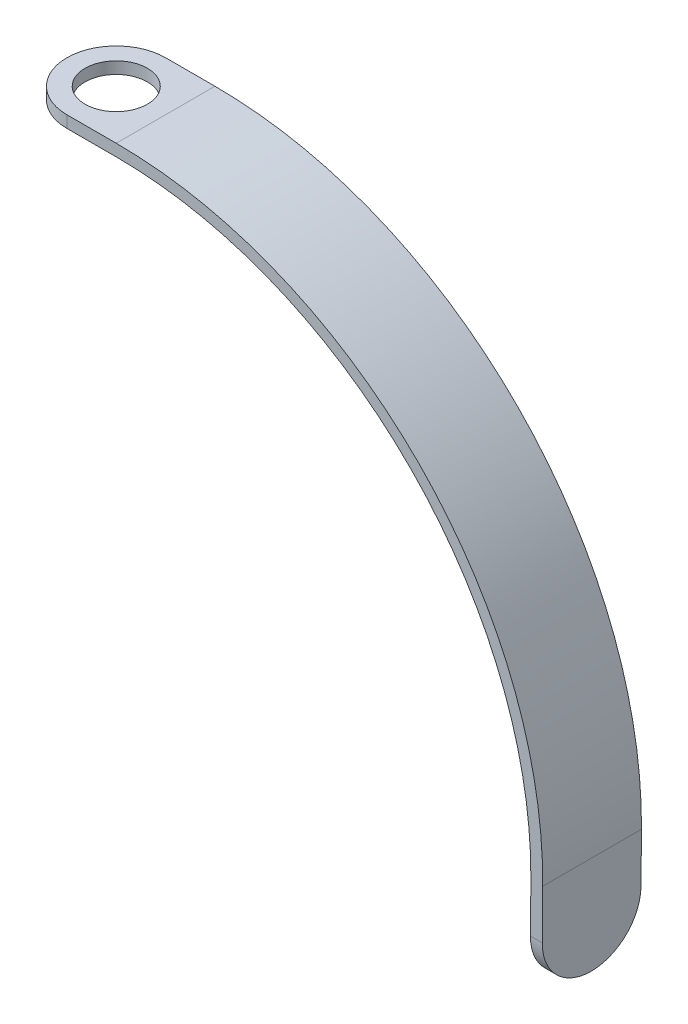
ISO-10303-21;
HEADER;
FILE_DESCRIPTION(('STEP AP214'),'2;1');
FILE_NAME('part.step','',(''),(''),'','','');
FILE_SCHEMA(('AUTOMOTIVE_DESIGN { 1 0 10303 214 1 1 1 1 }'));
ENDSEC;
DATA;
#1=APPLICATION_CONTEXT('core data for automotive mechanical design processes');
#2=APPLICATION_PROTOCOL_DEFINITION('international standard','automotive_design',2000,#1);
#3=PRODUCT_CONTEXT('',#1,'mechanical');
#4=PRODUCT('Part','Part','',(#3));
#5=PRODUCT_RELATED_PRODUCT_CATEGORY('part','',(#4));
#6=PRODUCT_DEFINITION_FORMATION('','',#4);
#7=PRODUCT_DEFINITION_CONTEXT('part definition',#1,'design');
#8=PRODUCT_DEFINITION('design','',#6,#7);
#9=PRODUCT_DEFINITION_SHAPE('','',#8);
#10=(LENGTH_UNIT() NAMED_UNIT(*) SI_UNIT(.MILLI.,.METRE.));
#11=(NAMED_UNIT(*) PLANE_ANGLE_UNIT() SI_UNIT($,.RADIAN.));
#12=(NAMED_UNIT(*) SI_UNIT($,.STERADIAN.) SOLID_ANGLE_UNIT());
#13=UNCERTAINTY_MEASURE_WITH_UNIT(LENGTH_MEASURE(1.E-05),#10,'distance_accuracy_value','');
#14=(GEOMETRIC_REPRESENTATION_CONTEXT(3) GLOBAL_UNCERTAINTY_ASSIGNED_CONTEXT((#13)) GLOBAL_UNIT_ASSIGNED_CONTEXT((#10,
#11,#12)) REPRESENTATION_CONTEXT('',''));
#15=CARTESIAN_POINT('',(0.,0.,0.));
#16=DIRECTION('',(0.,0.,1.));
#17=DIRECTION('',(1.,0.,0.));
#18=AXIS2_PLACEMENT_3D('',#15,#16,#17);
#19=CARTESIAN_POINT('',(0.,0.,25.));
#20=DIRECTION('',(0.,0.,-1.));
#21=DIRECTION('',(-1.,0.,0.));
#22=AXIS2_PLACEMENT_3D('',#19,#20,#21);
#23=CYLINDRICAL_SURFACE('',#22,105.);
#24=CARTESIAN_POINT('',(0.,0.,0.));
#25=DIRECTION('',(0.,0.,-1.));
#26=DIRECTION('',(-1.,0.,0.));
#27=AXIS2_PLACEMENT_3D('',#24,#25,#26);
#28=CIRCLE('',#27,105.);
#29=CARTESIAN_POINT('',(0.,105.,0.));
#30=VERTEX_POINT('',#29);
#31=CARTESIAN_POINT('',(104.996001921738,-0.916286227329613,0.));
#32=VERTEX_POINT('',#31);
#33=EDGE_CURVE('E150',#30,#32,#28,.T.);
#34=ORIENTED_EDGE('',*,*,#33,.T.);
#35=DIRECTION('',(0.,0.,-1.));
#36=VECTOR('',#35,1.);
#37=CARTESIAN_POINT('',(104.996001921738,-0.916286227329613,25.));
#38=LINE('',#37,#36);
#39=CARTESIAN_POINT('',(104.996001921738,-0.916286227329613,25.));
#40=VERTEX_POINT('',#39);
#41=EDGE_CURVE('E129',#40,#32,#38,.T.);
#42=ORIENTED_EDGE('',*,*,#41,.F.);
#43=CARTESIAN_POINT('',(0.,0.,25.));
#44=DIRECTION('',(0.,0.,-1.));
#45=DIRECTION('',(-1.,0.,0.));
#46=AXIS2_PLACEMENT_3D('',#43,#44,#45);
#47=CIRCLE('',#46,105.);
#48=CARTESIAN_POINT('',(0.,105.,25.));
#49=VERTEX_POINT('',#48);
#50=EDGE_CURVE('E137',#49,#40,#47,.T.);
#51=ORIENTED_EDGE('',*,*,#50,.F.);
#52=DIRECTION('',(0.,0.,-1.));
#53=VECTOR('',#52,1.);
#54=CARTESIAN_POINT('',(0.,105.,25.));
#55=LINE('',#54,#53);
#56=EDGE_CURVE('E226',#49,#30,#55,.T.);
#57=ORIENTED_EDGE('',*,*,#56,.T.);
#58=EDGE_LOOP('',(#34,#42,#51,#57));
#59=FACE_BOUND('',#58,.T.);
#60=ADVANCED_FACE('F45',(#59),#23,.F.);
#61=CARTESIAN_POINT('',(104.996001921738,-0.916286227329613,25.));
#62=DIRECTION('',(0.999961923064171,-0.00872653549837843,0.));
#63=DIRECTION('',(0.00872653549837843,0.999961923064171,0.));
#64=AXIS2_PLACEMENT_3D('',#61,#62,#63);
#65=PLANE('',#64);
#66=CARTESIAN_POINT('',(104.886920228008,-13.4158102656318,12.5));
#67=DIRECTION('',(0.999961923064171,-0.00872653549837844,0.));
#68=DIRECTION('',(0.00872653549837844,0.999961923064171,0.));
#69=AXIS2_PLACEMENT_3D('',#66,#67,#68);
#70=CIRCLE('',#69,3.225);
#71=CARTESIAN_POINT('',(104.915063304991,-10.1909330637499,12.5));
#72=VERTEX_POINT('',#71);
#73=EDGE_CURVE('E314',#72,#72,#70,.T.);
#74=ORIENTED_EDGE('',*,*,#73,.T.);
#75=EDGE_LOOP('',(#74));
#76=FACE_BOUND('',#75,.T.);
#77=DIRECTION('',(-0.00872653549837843,-0.999961923064171,0.));
#78=VECTOR('',#77,1.);
#79=CARTESIAN_POINT('',(104.996001921738,-0.916286227329613,0.));
#80=LINE('',#79,#78);
#81=CARTESIAN_POINT('',(104.886920228008,-13.4158102656317,0.));
#82=VERTEX_POINT('',#81);
#83=EDGE_CURVE('E198',#32,#82,#80,.T.);
#84=ORIENTED_EDGE('',*,*,#83,.T.);
#85=CARTESIAN_POINT('',(104.886920228008,-13.4158102656317,12.5));
#86=DIRECTION('',(0.999961923064171,-0.00872653549837843,0.));
#87=DIRECTION('',(0.00872653549837843,0.999961923064171,0.));
#88=AXIS2_PLACEMENT_3D('',#85,#86,#87);
#89=CIRCLE('',#88,12.5);
#90=CARTESIAN_POINT('',(104.777838534279,-25.9153343039339,12.5));
#91=VERTEX_POINT('',#90);
#92=EDGE_CURVE('E175',#82,#91,#89,.F.);
#93=ORIENTED_EDGE('',*,*,#92,.T.);
#94=CARTESIAN_POINT('',(104.886920228008,-13.4158102656317,12.5));
#95=DIRECTION('',(0.999961923064171,-0.00872653549837843,0.));
#96=DIRECTION('',(0.00872653549837843,0.999961923064171,0.));
#97=AXIS2_PLACEMENT_3D('',#94,#95,#96);
#98=CIRCLE('',#97,12.5);
#99=CARTESIAN_POINT('',(104.886920228008,-13.4158102656317,25.));
#100=VERTEX_POINT('',#99);
#101=EDGE_CURVE('E132',#91,#100,#98,.F.);
#102=ORIENTED_EDGE('',*,*,#101,.T.);
#103=DIRECTION('',(-0.00872653549837843,-0.999961923064171,0.));
#104=VECTOR('',#103,1.);
#105=CARTESIAN_POINT('',(104.996001921738,-0.916286227329613,25.));
#106=LINE('',#105,#104);
#107=EDGE_CURVE('E124',#40,#100,#106,.T.);
#108=ORIENTED_EDGE('',*,*,#107,.F.);
#109=ORIENTED_EDGE('',*,*,#41,.T.);
#110=EDGE_LOOP('',(#84,#93,#102,#108,#109));
#111=FACE_BOUND('',#110,.T.);
#112=ADVANCED_FACE('F127',(#76,#111),#65,.F.);
#113=CARTESIAN_POINT('',(107.777724303471,-25.941513910429,25.));
#114=DIRECTION('',(-0.999961923064171,0.00872653549837732,0.));
#115=DIRECTION('',(-0.00872653549837732,-0.999961923064171,0.));
#116=AXIS2_PLACEMENT_3D('',#113,#114,#115);
#117=PLANE('',#116);
#118=CARTESIAN_POINT('',(107.886805997201,-13.4419898721269,12.5));
#119=DIRECTION('',(-0.999961923064171,0.00872653549837732,0.));
#120=DIRECTION('',(-0.00872653549837732,-0.999961923064171,0.));
#121=AXIS2_PLACEMENT_3D('',#118,#119,#120);
#122=CIRCLE('',#121,12.5);
#123=CARTESIAN_POINT('',(107.886805997201,-13.4419898721269,25.));
#124=VERTEX_POINT('',#123);
#125=CARTESIAN_POINT('',(107.777724303471,-25.941513910429,12.5));
#126=VERTEX_POINT('',#125);
#127=EDGE_CURVE('E152',#124,#126,#122,.F.);
#128=ORIENTED_EDGE('',*,*,#127,.T.);
#129=CARTESIAN_POINT('',(107.886805997201,-13.4419898721269,12.5));
#130=DIRECTION('',(-0.999961923064171,0.00872653549837732,0.));
#131=DIRECTION('',(-0.00872653549837732,-0.999961923064171,0.));
#132=AXIS2_PLACEMENT_3D('',#129,#130,#131);
#133=CIRCLE('',#132,12.5);
#134=CARTESIAN_POINT('',(107.886805997201,-13.4419898721269,0.));
#135=VERTEX_POINT('',#134);
#136=EDGE_CURVE('E157',#126,#135,#133,.F.);
#137=ORIENTED_EDGE('',*,*,#136,.T.);
#138=DIRECTION('',(0.00872653549837732,0.999961923064171,0.));
#139=VECTOR('',#138,1.);
#140=CARTESIAN_POINT('',(107.777724303471,-25.941513910429,0.));
#141=LINE('',#140,#139);
#142=CARTESIAN_POINT('',(107.99588769093,-0.942465833824697,0.));
#143=VERTEX_POINT('',#142);
#144=EDGE_CURVE('E230',#135,#143,#141,.T.);
#145=ORIENTED_EDGE('',*,*,#144,.T.);
#146=DIRECTION('',(0.,0.,-1.));
#147=VECTOR('',#146,1.);
#148=CARTESIAN_POINT('',(107.99588769093,-0.942465833824697,25.));
#149=LINE('',#148,#147);
#150=CARTESIAN_POINT('',(107.99588769093,-0.942465833824697,25.));
#151=VERTEX_POINT('',#150);
#152=EDGE_CURVE('E153',#151,#143,#149,.T.);
#153=ORIENTED_EDGE('',*,*,#152,.F.);
#154=DIRECTION('',(0.00872653549837732,0.999961923064171,0.));
#155=VECTOR('',#154,1.);
#156=CARTESIAN_POINT('',(107.777724303471,-25.941513910429,25.));
#157=LINE('',#156,#155);
#158=EDGE_CURVE('E136',#124,#151,#157,.T.);
#159=ORIENTED_EDGE('',*,*,#158,.F.);
#160=EDGE_LOOP('',(#128,#137,#145,#153,#159));
#161=FACE_BOUND('',#160,.T.);
#162=ADVANCED_FACE('F263',(#161),#117,.F.);
#163=CARTESIAN_POINT('',(0.,0.,25.));
#164=DIRECTION('',(0.,0.,-1.));
#165=DIRECTION('',(-1.,0.,0.));
#166=AXIS2_PLACEMENT_3D('',#163,#164,#165);
#167=CYLINDRICAL_SURFACE('',#166,108.);
#168=CARTESIAN_POINT('',(0.,0.,0.));
#169=DIRECTION('',(0.,0.,1.));
#170=DIRECTION('',(-1.,0.,0.));
#171=AXIS2_PLACEMENT_3D('',#168,#169,#170);
#172=CIRCLE('',#171,108.);
#173=CARTESIAN_POINT('',(0.,108.,0.));
#174=VERTEX_POINT('',#173);
#175=EDGE_CURVE('E233',#143,#174,#172,.T.);
#176=ORIENTED_EDGE('',*,*,#175,.T.);
#177=DIRECTION('',(0.,0.,-1.));
#178=VECTOR('',#177,1.);
#179=CARTESIAN_POINT('',(0.,108.,25.));
#180=LINE('',#179,#178);
#181=CARTESIAN_POINT('',(0.,108.,25.));
#182=VERTEX_POINT('',#181);
#183=EDGE_CURVE('E160',#182,#174,#180,.T.);
#184=ORIENTED_EDGE('',*,*,#183,.F.);
#185=CARTESIAN_POINT('',(0.,0.,25.));
#186=DIRECTION('',(0.,0.,1.));
#187=DIRECTION('',(-1.,0.,0.));
#188=AXIS2_PLACEMENT_3D('',#185,#186,#187);
#189=CIRCLE('',#188,108.);
#190=EDGE_CURVE('E218',#151,#182,#189,.T.);
#191=ORIENTED_EDGE('',*,*,#190,.F.);
#192=ORIENTED_EDGE('',*,*,#152,.T.);
#193=EDGE_LOOP('',(#176,#184,#191,#192));
#194=FACE_BOUND('',#193,.T.);
#195=ADVANCED_FACE('F261',(#194),#167,.T.);
#196=CARTESIAN_POINT('',(0.,108.,25.));
#197=DIRECTION('',(0.,-1.,0.));
#198=DIRECTION('',(0.,0.,-1.));
#199=AXIS2_PLACEMENT_3D('',#196,#197,#198);
#200=PLANE('',#199);
#201=CARTESIAN_POINT('',(-12.5,108.,12.5));
#202=DIRECTION('',(0.,1.,0.));
#203=DIRECTION('',(0.,0.,1.));
#204=AXIS2_PLACEMENT_3D('',#201,#202,#203);
#205=CIRCLE('',#204,7.89);
#206=CARTESIAN_POINT('',(-12.5,108.,20.39));
#207=VERTEX_POINT('',#206);
#208=EDGE_CURVE('E206',#207,#207,#205,.T.);
#209=ORIENTED_EDGE('',*,*,#208,.F.);
#210=EDGE_LOOP('',(#209));
#211=FACE_BOUND('',#210,.T.);
#212=CARTESIAN_POINT('',(-12.5,108.,12.5));
#213=DIRECTION('',(0.,-1.,0.));
#214=DIRECTION('',(0.,0.,-1.));
#215=AXIS2_PLACEMENT_3D('',#212,#213,#214);
#216=CIRCLE('',#215,12.5);
#217=CARTESIAN_POINT('',(-12.5,108.,0.));
#218=VERTEX_POINT('',#217);
#219=CARTESIAN_POINT('',(-25.,108.,12.5));
#220=VERTEX_POINT('',#219);
#221=EDGE_CURVE('E55',#218,#220,#216,.F.);
#222=ORIENTED_EDGE('',*,*,#221,.T.);
#223=CARTESIAN_POINT('',(-12.5,108.,12.5));
#224=DIRECTION('',(0.,-1.,0.));
#225=DIRECTION('',(0.,0.,-1.));
#226=AXIS2_PLACEMENT_3D('',#223,#224,#225);
#227=CIRCLE('',#226,12.5);
#228=CARTESIAN_POINT('',(-12.5,108.,25.));
#229=VERTEX_POINT('',#228);
#230=EDGE_CURVE('E11',#220,#229,#227,.F.);
#231=ORIENTED_EDGE('',*,*,#230,.T.);
#232=DIRECTION('',(-1.,0.,0.));
#233=VECTOR('',#232,1.);
#234=CARTESIAN_POINT('',(0.,108.,25.));
#235=LINE('',#234,#233);
#236=EDGE_CURVE('E221',#182,#229,#235,.T.);
#237=ORIENTED_EDGE('',*,*,#236,.F.);
#238=ORIENTED_EDGE('',*,*,#183,.T.);
#239=DIRECTION('',(-1.,0.,0.));
#240=VECTOR('',#239,1.);
#241=CARTESIAN_POINT('',(0.,108.,0.));
#242=LINE('',#241,#240);
#243=EDGE_CURVE('E236',#174,#218,#242,.T.);
#244=ORIENTED_EDGE('',*,*,#243,.T.);
#245=EDGE_LOOP('',(#222,#231,#237,#238,#244));
#246=FACE_BOUND('',#245,.T.);
#247=ADVANCED_FACE('F247',(#211,#246),#200,.F.);
#248=CARTESIAN_POINT('',(-25.,105.,25.));
#249=DIRECTION('',(0.,1.,0.));
#250=DIRECTION('',(0.,0.,1.));
#251=AXIS2_PLACEMENT_3D('',#248,#249,#250);
#252=PLANE('',#251);
#253=CARTESIAN_POINT('',(-12.5,105.,12.5));
#254=DIRECTION('',(0.,1.,0.));
#255=DIRECTION('',(0.,0.,1.));
#256=AXIS2_PLACEMENT_3D('',#253,#254,#255);
#257=CIRCLE('',#256,7.89);
#258=CARTESIAN_POINT('',(-12.5,105.,20.39));
#259=VERTEX_POINT('',#258);
#260=EDGE_CURVE('E201',#259,#259,#257,.F.);
#261=ORIENTED_EDGE('',*,*,#260,.F.);
#262=EDGE_LOOP('',(#261));
#263=FACE_BOUND('',#262,.T.);
#264=DIRECTION('',(1.,0.,0.));
#265=VECTOR('',#264,1.);
#266=CARTESIAN_POINT('',(-25.,105.,25.));
#267=LINE('',#266,#265);
#268=CARTESIAN_POINT('',(-12.5,105.,25.));
#269=VERTEX_POINT('',#268);
#270=EDGE_CURVE('E142',#269,#49,#267,.T.);
#271=ORIENTED_EDGE('',*,*,#270,.F.);
#272=CARTESIAN_POINT('',(-12.5,105.,12.5));
#273=DIRECTION('',(0.,1.,0.));
#274=DIRECTION('',(0.,0.,1.));
#275=AXIS2_PLACEMENT_3D('',#272,#273,#274);
#276=CIRCLE('',#275,12.5);
#277=CARTESIAN_POINT('',(-25.,105.,12.5));
#278=VERTEX_POINT('',#277);
#279=EDGE_CURVE('E69',#269,#278,#276,.F.);
#280=ORIENTED_EDGE('',*,*,#279,.T.);
#281=CARTESIAN_POINT('',(-12.5,105.,12.5));
#282=DIRECTION('',(0.,1.,0.));
#283=DIRECTION('',(0.,0.,1.));
#284=AXIS2_PLACEMENT_3D('',#281,#282,#283);
#285=CIRCLE('',#284,12.5);
#286=CARTESIAN_POINT('',(-12.5,105.,0.));
#287=VERTEX_POINT('',#286);
#288=EDGE_CURVE('E184',#278,#287,#285,.F.);
#289=ORIENTED_EDGE('',*,*,#288,.T.);
#290=DIRECTION('',(1.,0.,0.));
#291=VECTOR('',#290,1.);
#292=CARTESIAN_POINT('',(-25.,105.,0.));
#293=LINE('',#292,#291);
#294=EDGE_CURVE('E147',#287,#30,#293,.T.);
#295=ORIENTED_EDGE('',*,*,#294,.T.);
#296=ORIENTED_EDGE('',*,*,#56,.F.);
#297=EDGE_LOOP('',(#271,#280,#289,#295,#296));
#298=FACE_BOUND('',#297,.T.);
#299=ADVANCED_FACE('F291',(#263,#298),#252,.F.);
#300=CARTESIAN_POINT('',(0.,0.,25.));
#301=DIRECTION('',(0.,0.,-1.));
#302=DIRECTION('',(-1.,0.,0.));
#303=AXIS2_PLACEMENT_3D('',#300,#301,#302);
#304=PLANE('',#303);
#305=ORIENTED_EDGE('',*,*,#107,.T.);
#306=DIRECTION('',(0.999961923064171,-0.00872653549837655,0.));
#307=VECTOR('',#306,1.);
#308=CARTESIAN_POINT('',(-0.109081693729707,-12.4995240383022,25.));
#309=LINE('',#308,#307);
#310=EDGE_CURVE('E181',#100,#124,#309,.T.);
#311=ORIENTED_EDGE('',*,*,#310,.T.);
#312=ORIENTED_EDGE('',*,*,#158,.T.);
#313=ORIENTED_EDGE('',*,*,#190,.T.);
#314=ORIENTED_EDGE('',*,*,#236,.T.);
#315=DIRECTION('',(0.,-1.,0.));
#316=VECTOR('',#315,1.);
#317=CARTESIAN_POINT('',(-12.5,0.,25.));
#318=LINE('',#317,#316);
#319=EDGE_CURVE('E178',#229,#269,#318,.T.);
#320=ORIENTED_EDGE('',*,*,#319,.T.);
#321=ORIENTED_EDGE('',*,*,#270,.T.);
#322=ORIENTED_EDGE('',*,*,#50,.T.);
#323=EDGE_LOOP('',(#305,#311,#312,#313,#314,#320,#321,#322));
#324=FACE_BOUND('',#323,.T.);
#325=ADVANCED_FACE('F140',(#324),#304,.F.);
#326=CARTESIAN_POINT('',(0.,0.,0.));
#327=DIRECTION('',(0.,0.,-1.));
#328=DIRECTION('',(-1.,0.,0.));
#329=AXIS2_PLACEMENT_3D('',#326,#327,#328);
#330=PLANE('',#329);
#331=ORIENTED_EDGE('',*,*,#144,.F.);
#332=DIRECTION('',(0.999961923064171,-0.00872653549837655,0.));
#333=VECTOR('',#332,1.);
#334=CARTESIAN_POINT('',(104.886920228008,-13.4158102656317,0.));
#335=LINE('',#334,#333);
#336=EDGE_CURVE('E169',#135,#82,#335,.F.);
#337=ORIENTED_EDGE('',*,*,#336,.T.);
#338=ORIENTED_EDGE('',*,*,#83,.F.);
#339=ORIENTED_EDGE('',*,*,#33,.F.);
#340=ORIENTED_EDGE('',*,*,#294,.F.);
#341=DIRECTION('',(0.,-1.,0.));
#342=VECTOR('',#341,1.);
#343=CARTESIAN_POINT('',(-12.5,108.,0.));
#344=LINE('',#343,#342);
#345=EDGE_CURVE('E166',#287,#218,#344,.F.);
#346=ORIENTED_EDGE('',*,*,#345,.T.);
#347=ORIENTED_EDGE('',*,*,#243,.F.);
#348=ORIENTED_EDGE('',*,*,#175,.F.);
#349=EDGE_LOOP('',(#331,#337,#338,#339,#340,#346,#347,#348));
#350=FACE_BOUND('',#349,.T.);
#351=ADVANCED_FACE('F253',(#350),#330,.T.);
#352=CARTESIAN_POINT('',(-0.109081693729707,-12.4995240383022,12.5));
#353=DIRECTION('',(0.999961923064171,-0.00872653549837655,0.));
#354=DIRECTION('',(0.00872653549837655,0.999961923064171,0.));
#355=AXIS2_PLACEMENT_3D('',#352,#353,#354);
#356=CYLINDRICAL_SURFACE('',#355,12.5);
#357=ORIENTED_EDGE('',*,*,#310,.F.);
#358=ORIENTED_EDGE('',*,*,#101,.F.);
#359=DIRECTION('',(0.999961923064171,-0.00872653549837655,0.));
#360=VECTOR('',#359,1.);
#361=CARTESIAN_POINT('',(104.777838534279,-25.9153343039339,12.5));
#362=LINE('',#361,#360);
#363=EDGE_CURVE('E190',#126,#91,#362,.F.);
#364=ORIENTED_EDGE('',*,*,#363,.F.);
#365=ORIENTED_EDGE('',*,*,#127,.F.);
#366=EDGE_LOOP('',(#357,#358,#364,#365));
#367=FACE_BOUND('',#366,.T.);
#368=ADVANCED_FACE('F268',(#367),#356,.T.);
#369=CARTESIAN_POINT('',(104.886920228008,-13.4158102656317,12.5));
#370=DIRECTION('',(-0.999961923064171,0.00872653549837655,0.));
#371=DIRECTION('',(-0.00872653549837655,-0.999961923064171,0.));
#372=AXIS2_PLACEMENT_3D('',#369,#370,#371);
#373=CYLINDRICAL_SURFACE('',#372,12.5);
#374=ORIENTED_EDGE('',*,*,#92,.F.);
#375=ORIENTED_EDGE('',*,*,#336,.F.);
#376=ORIENTED_EDGE('',*,*,#136,.F.);
#377=ORIENTED_EDGE('',*,*,#363,.T.);
#378=EDGE_LOOP('',(#374,#375,#376,#377));
#379=FACE_BOUND('',#378,.T.);
#380=ADVANCED_FACE('F266',(#379),#373,.T.);
#381=CARTESIAN_POINT('',(-12.5,108.,12.5));
#382=DIRECTION('',(0.,1.,0.));
#383=DIRECTION('',(0.,0.,1.));
#384=AXIS2_PLACEMENT_3D('',#381,#382,#383);
#385=CYLINDRICAL_SURFACE('',#384,12.5);
#386=DIRECTION('',(0.,-1.,0.));
#387=VECTOR('',#386,1.);
#388=CARTESIAN_POINT('',(-25.,105.,12.5));
#389=LINE('',#388,#387);
#390=EDGE_CURVE('E49',#220,#278,#389,.T.);
#391=ORIENTED_EDGE('',*,*,#390,.F.);
#392=ORIENTED_EDGE('',*,*,#221,.F.);
#393=ORIENTED_EDGE('',*,*,#345,.F.);
#394=ORIENTED_EDGE('',*,*,#288,.F.);
#395=EDGE_LOOP('',(#391,#392,#393,#394));
#396=FACE_BOUND('',#395,.T.);
#397=ADVANCED_FACE('F47',(#396),#385,.T.);
#398=CARTESIAN_POINT('',(-12.5,0.,12.5));
#399=DIRECTION('',(0.,-1.,0.));
#400=DIRECTION('',(0.,0.,-1.));
#401=AXIS2_PLACEMENT_3D('',#398,#399,#400);
#402=CYLINDRICAL_SURFACE('',#401,12.5);
#403=ORIENTED_EDGE('',*,*,#230,.F.);
#404=ORIENTED_EDGE('',*,*,#390,.T.);
#405=ORIENTED_EDGE('',*,*,#279,.F.);
#406=ORIENTED_EDGE('',*,*,#319,.F.);
#407=EDGE_LOOP('',(#403,#404,#405,#406));
#408=FACE_BOUND('',#407,.T.);
#409=ADVANCED_FACE('F258',(#408),#402,.T.);
#410=CARTESIAN_POINT('',(-12.5,-25.942513910429,12.5));
#411=DIRECTION('',(0.,1.,0.));
#412=DIRECTION('',(0.,0.,1.));
#413=AXIS2_PLACEMENT_3D('',#410,#411,#412);
#414=CYLINDRICAL_SURFACE('',#413,7.89);
#415=ORIENTED_EDGE('',*,*,#208,.T.);
#416=EDGE_LOOP('',(#415));
#417=FACE_BOUND('',#416,.T.);
#418=ORIENTED_EDGE('',*,*,#260,.T.);
#419=EDGE_LOOP('',(#418));
#420=FACE_BOUND('',#419,.T.);
#421=ADVANCED_FACE('F298',(#417,#420),#414,.F.);
#422=CARTESIAN_POINT('',(98.8871486896233,-13.3634510526415,12.5));
#423=DIRECTION('',(0.999961923064171,-0.00872653549837843,0.));
#424=DIRECTION('',(0.00872653549837844,0.999961923064171,0.));
#425=AXIS2_PLACEMENT_3D('',#422,#423,#424);
#426=CYLINDRICAL_SURFACE('',#425,3.225);
#427=CARTESIAN_POINT('',(98.8871486896233,-13.3634510526415,12.5));
#428=DIRECTION('',(0.999961923064171,-0.00872653549837844,0.));
#429=DIRECTION('',(0.00872653549837844,0.999961923064171,0.));
#430=AXIS2_PLACEMENT_3D('',#427,#428,#429);
#431=CIRCLE('',#430,3.225);
#432=CARTESIAN_POINT('',(98.9152917666056,-10.1385738507596,12.5));
#433=VERTEX_POINT('',#432);
#434=EDGE_CURVE('E212',#433,#433,#431,.T.);
#435=ORIENTED_EDGE('',*,*,#434,.T.);
#436=EDGE_LOOP('',(#435));
#437=FACE_BOUND('',#436,.T.);
#438=ORIENTED_EDGE('',*,*,#73,.F.);
#439=EDGE_LOOP('',(#438));
#440=FACE_BOUND('',#439,.T.);
#441=ADVANCED_FACE('F301',(#437,#440),#426,.T.);
#442=CARTESIAN_POINT('',(98.8871486896233,-13.3634510526415,12.5));
#443=DIRECTION('',(0.999961923064171,-0.00872653549837844,0.));
#444=DIRECTION('',(0.00872653549837844,0.999961923064171,0.));
#445=AXIS2_PLACEMENT_3D('',#442,#443,#444);
#446=PLANE('',#445);
#447=ORIENTED_EDGE('',*,*,#434,.F.);
#448=EDGE_LOOP('',(#447));
#449=FACE_BOUND('',#448,.T.);
#450=ADVANCED_FACE('F305',(#449),#446,.F.);
#451=CLOSED_SHELL('',(#60,#112,#162,#195,#247,#299,#325,#351,#368,#380,#397,#409,#421,#441,#450));
#452=MANIFOLD_SOLID_BREP('B2',#451);
#453=ADVANCED_BREP_SHAPE_REPRESENTATION('',(#18,#452),#14);
#454=SHAPE_DEFINITION_REPRESENTATION(#9,#453);
ENDSEC;
END-ISO-10303-21;
